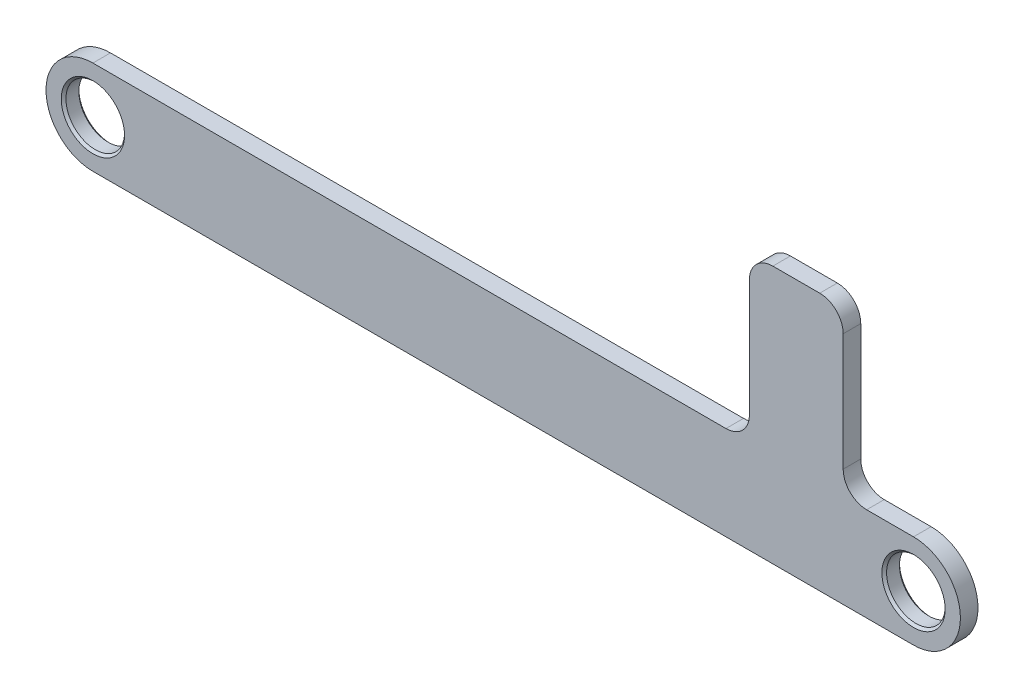
ISO-10303-21;
HEADER;
FILE_DESCRIPTION(('STEP AP214'),'2;1');
FILE_NAME('part.step','',(''),(''),'','','');
FILE_SCHEMA(('AUTOMOTIVE_DESIGN { 1 0 10303 214 1 1 1 1 }'));
ENDSEC;
DATA;
#1=APPLICATION_CONTEXT('core data for automotive mechanical design processes');
#2=APPLICATION_PROTOCOL_DEFINITION('international standard','automotive_design',2000,#1);
#3=PRODUCT_CONTEXT('',#1,'mechanical');
#4=PRODUCT('Part','Part','',(#3));
#5=PRODUCT_RELATED_PRODUCT_CATEGORY('part','',(#4));
#6=PRODUCT_DEFINITION_FORMATION('','',#4);
#7=PRODUCT_DEFINITION_CONTEXT('part definition',#1,'design');
#8=PRODUCT_DEFINITION('design','',#6,#7);
#9=PRODUCT_DEFINITION_SHAPE('','',#8);
#10=(LENGTH_UNIT() NAMED_UNIT(*) SI_UNIT(.MILLI.,.METRE.));
#11=(NAMED_UNIT(*) PLANE_ANGLE_UNIT() SI_UNIT($,.RADIAN.));
#12=(NAMED_UNIT(*) SI_UNIT($,.STERADIAN.) SOLID_ANGLE_UNIT());
#13=UNCERTAINTY_MEASURE_WITH_UNIT(LENGTH_MEASURE(1.E-05),#10,'distance_accuracy_value','');
#14=(GEOMETRIC_REPRESENTATION_CONTEXT(3) GLOBAL_UNCERTAINTY_ASSIGNED_CONTEXT((#13)) GLOBAL_UNIT_ASSIGNED_CONTEXT((#10,
#11,#12)) REPRESENTATION_CONTEXT('',''));
#15=CARTESIAN_POINT('',(0.,0.,0.));
#16=DIRECTION('',(0.,0.,1.));
#17=DIRECTION('',(1.,0.,0.));
#18=AXIS2_PLACEMENT_3D('',#15,#16,#17);
#19=CARTESIAN_POINT('',(0.,0.,0.75));
#20=DIRECTION('',(0.,0.,1.));
#21=DIRECTION('',(1.,0.,0.));
#22=AXIS2_PLACEMENT_3D('',#19,#20,#21);
#23=PLANE('',#22);
#24=CARTESIAN_POINT('',(0.,0.,0.75));
#25=DIRECTION('',(0.,0.,1.));
#26=DIRECTION('',(1.,0.,0.));
#27=AXIS2_PLACEMENT_3D('',#24,#25,#26);
#28=CIRCLE('',#27,2.70000000000001);
#29=CARTESIAN_POINT('',(2.70000000000001,0.,0.75));
#30=VERTEX_POINT('',#29);
#31=EDGE_CURVE('E229',#30,#30,#28,.F.);
#32=ORIENTED_EDGE('',*,*,#31,.T.);
#33=EDGE_LOOP('',(#32));
#34=FACE_BOUND('',#33,.T.);
#35=CARTESIAN_POINT('',(-70.,0.,0.75));
#36=DIRECTION('',(0.,0.,1.));
#37=DIRECTION('',(1.,0.,0.));
#38=AXIS2_PLACEMENT_3D('',#35,#36,#37);
#39=CIRCLE('',#38,2.69999999999998);
#40=CARTESIAN_POINT('',(-67.3,0.,0.75));
#41=VERTEX_POINT('',#40);
#42=EDGE_CURVE('E226',#41,#41,#39,.F.);
#43=ORIENTED_EDGE('',*,*,#42,.T.);
#44=EDGE_LOOP('',(#43));
#45=FACE_BOUND('',#44,.T.);
#46=DIRECTION('',(0.,1.,0.));
#47=VECTOR('',#46,1.);
#48=CARTESIAN_POINT('',(-6.,18.,0.75));
#49=LINE('',#48,#47);
#50=CARTESIAN_POINT('',(-6.,6.,0.75));
#51=VERTEX_POINT('',#50);
#52=CARTESIAN_POINT('',(-6.,16.,0.75));
#53=VERTEX_POINT('',#52);
#54=EDGE_CURVE('E163',#51,#53,#49,.T.);
#55=ORIENTED_EDGE('',*,*,#54,.T.);
#56=CARTESIAN_POINT('',(-8.,16.,0.75));
#57=DIRECTION('',(0.,0.,1.));
#58=DIRECTION('',(1.,0.,0.));
#59=AXIS2_PLACEMENT_3D('',#56,#57,#58);
#60=CIRCLE('',#59,2.);
#61=CARTESIAN_POINT('',(-8.,18.,0.75));
#62=VERTEX_POINT('',#61);
#63=EDGE_CURVE('E49',#53,#62,#60,.T.);
#64=ORIENTED_EDGE('',*,*,#63,.T.);
#65=DIRECTION('',(-1.,0.,0.));
#66=VECTOR('',#65,1.);
#67=CARTESIAN_POINT('',(-14.,18.,0.75));
#68=LINE('',#67,#66);
#69=CARTESIAN_POINT('',(-12.,18.,0.75));
#70=VERTEX_POINT('',#69);
#71=EDGE_CURVE('E165',#62,#70,#68,.T.);
#72=ORIENTED_EDGE('',*,*,#71,.T.);
#73=CARTESIAN_POINT('',(-12.,16.,0.75));
#74=DIRECTION('',(0.,0.,1.));
#75=DIRECTION('',(1.,0.,0.));
#76=AXIS2_PLACEMENT_3D('',#73,#74,#75);
#77=CIRCLE('',#76,2.);
#78=CARTESIAN_POINT('',(-14.,16.,0.75));
#79=VERTEX_POINT('',#78);
#80=EDGE_CURVE('E204',#70,#79,#77,.T.);
#81=ORIENTED_EDGE('',*,*,#80,.T.);
#82=DIRECTION('',(0.,-1.,0.));
#83=VECTOR('',#82,1.);
#84=CARTESIAN_POINT('',(-14.,4.,0.75));
#85=LINE('',#84,#83);
#86=CARTESIAN_POINT('',(-14.,6.,0.75));
#87=VERTEX_POINT('',#86);
#88=EDGE_CURVE('E167',#79,#87,#85,.T.);
#89=ORIENTED_EDGE('',*,*,#88,.T.);
#90=CARTESIAN_POINT('',(-16.,6.,0.75));
#91=DIRECTION('',(0.,0.,1.));
#92=DIRECTION('',(1.,0.,0.));
#93=AXIS2_PLACEMENT_3D('',#90,#91,#92);
#94=CIRCLE('',#93,2.);
#95=CARTESIAN_POINT('',(-16.,4.,0.75));
#96=VERTEX_POINT('',#95);
#97=EDGE_CURVE('E209',#87,#96,#94,.F.);
#98=ORIENTED_EDGE('',*,*,#97,.T.);
#99=DIRECTION('',(-1.,0.,0.));
#100=VECTOR('',#99,1.);
#101=CARTESIAN_POINT('',(-70.,3.99999999999999,0.75));
#102=LINE('',#101,#100);
#103=CARTESIAN_POINT('',(-70.,3.99999999999999,0.75));
#104=VERTEX_POINT('',#103);
#105=EDGE_CURVE('E170',#96,#104,#102,.T.);
#106=ORIENTED_EDGE('',*,*,#105,.T.);
#107=CARTESIAN_POINT('',(-70.,0.,0.75));
#108=DIRECTION('',(0.,0.,1.));
#109=DIRECTION('',(1.,0.,0.));
#110=AXIS2_PLACEMENT_3D('',#107,#108,#109);
#111=CIRCLE('',#110,4.);
#112=CARTESIAN_POINT('',(-70.,-4.00000000000001,0.75));
#113=VERTEX_POINT('',#112);
#114=EDGE_CURVE('E172',#104,#113,#111,.T.);
#115=ORIENTED_EDGE('',*,*,#114,.T.);
#116=DIRECTION('',(1.,0.,0.));
#117=VECTOR('',#116,1.);
#118=CARTESIAN_POINT('',(0.,-3.99999999999999,0.75));
#119=LINE('',#118,#117);
#120=CARTESIAN_POINT('',(0.,-3.99999999999999,0.75));
#121=VERTEX_POINT('',#120);
#122=EDGE_CURVE('E174',#113,#121,#119,.T.);
#123=ORIENTED_EDGE('',*,*,#122,.T.);
#124=CARTESIAN_POINT('',(0.,0.,0.75));
#125=DIRECTION('',(0.,0.,1.));
#126=DIRECTION('',(1.,0.,0.));
#127=AXIS2_PLACEMENT_3D('',#124,#125,#126);
#128=CIRCLE('',#127,3.99999999999999);
#129=CARTESIAN_POINT('',(0.,4.,0.75));
#130=VERTEX_POINT('',#129);
#131=EDGE_CURVE('E160',#121,#130,#128,.T.);
#132=ORIENTED_EDGE('',*,*,#131,.T.);
#133=DIRECTION('',(-1.,0.,0.));
#134=VECTOR('',#133,1.);
#135=CARTESIAN_POINT('',(-6.,4.,0.75));
#136=LINE('',#135,#134);
#137=CARTESIAN_POINT('',(-4.,4.,0.75));
#138=VERTEX_POINT('',#137);
#139=EDGE_CURVE('E135',#130,#138,#136,.T.);
#140=ORIENTED_EDGE('',*,*,#139,.T.);
#141=CARTESIAN_POINT('',(-4.,6.,0.75));
#142=DIRECTION('',(0.,0.,1.));
#143=DIRECTION('',(1.,0.,0.));
#144=AXIS2_PLACEMENT_3D('',#141,#142,#143);
#145=CIRCLE('',#144,2.);
#146=EDGE_CURVE('E212',#138,#51,#145,.F.);
#147=ORIENTED_EDGE('',*,*,#146,.T.);
#148=EDGE_LOOP('',(#55,#64,#72,#81,#89,#98,#106,#115,#123,#132,#140,#147));
#149=FACE_BOUND('',#148,.T.);
#150=ADVANCED_FACE('F27',(#34,#45,#149),#23,.T.);
#151=CARTESIAN_POINT('',(0.,0.,-0.75));
#152=DIRECTION('',(0.,0.,1.));
#153=DIRECTION('',(1.,0.,0.));
#154=AXIS2_PLACEMENT_3D('',#151,#152,#153);
#155=PLANE('',#154);
#156=CARTESIAN_POINT('',(0.,0.,-0.75));
#157=DIRECTION('',(0.,0.,1.));
#158=DIRECTION('',(1.,0.,0.));
#159=AXIS2_PLACEMENT_3D('',#156,#157,#158);
#160=CIRCLE('',#159,2.7);
#161=CARTESIAN_POINT('',(2.7,0.,-0.75));
#162=VERTEX_POINT('',#161);
#163=EDGE_CURVE('E217',#162,#162,#160,.T.);
#164=ORIENTED_EDGE('',*,*,#163,.T.);
#165=EDGE_LOOP('',(#164));
#166=FACE_BOUND('',#165,.T.);
#167=CARTESIAN_POINT('',(-70.,0.,-0.75));
#168=DIRECTION('',(0.,0.,1.));
#169=DIRECTION('',(1.,0.,0.));
#170=AXIS2_PLACEMENT_3D('',#167,#168,#169);
#171=CIRCLE('',#170,2.69999999999998);
#172=CARTESIAN_POINT('',(-67.3,0.,-0.75));
#173=VERTEX_POINT('',#172);
#174=EDGE_CURVE('E214',#173,#173,#171,.T.);
#175=ORIENTED_EDGE('',*,*,#174,.T.);
#176=EDGE_LOOP('',(#175));
#177=FACE_BOUND('',#176,.T.);
#178=DIRECTION('',(-1.,0.,0.));
#179=VECTOR('',#178,1.);
#180=CARTESIAN_POINT('',(-14.,18.,-0.75));
#181=LINE('',#180,#179);
#182=CARTESIAN_POINT('',(-8.,18.,-0.75));
#183=VERTEX_POINT('',#182);
#184=CARTESIAN_POINT('',(-12.,18.,-0.75));
#185=VERTEX_POINT('',#184);
#186=EDGE_CURVE('E149',#183,#185,#181,.T.);
#187=ORIENTED_EDGE('',*,*,#186,.F.);
#188=CARTESIAN_POINT('',(-8.,16.,-0.75));
#189=DIRECTION('',(0.,0.,1.));
#190=DIRECTION('',(1.,0.,0.));
#191=AXIS2_PLACEMENT_3D('',#188,#189,#190);
#192=CIRCLE('',#191,2.);
#193=CARTESIAN_POINT('',(-6.,16.,-0.75));
#194=VERTEX_POINT('',#193);
#195=EDGE_CURVE('E202',#183,#194,#192,.F.);
#196=ORIENTED_EDGE('',*,*,#195,.T.);
#197=DIRECTION('',(0.,1.,0.));
#198=VECTOR('',#197,1.);
#199=CARTESIAN_POINT('',(-6.,18.,-0.75));
#200=LINE('',#199,#198);
#201=CARTESIAN_POINT('',(-6.,6.,-0.75));
#202=VERTEX_POINT('',#201);
#203=EDGE_CURVE('E129',#202,#194,#200,.T.);
#204=ORIENTED_EDGE('',*,*,#203,.F.);
#205=CARTESIAN_POINT('',(-4.,6.,-0.75));
#206=DIRECTION('',(0.,0.,1.));
#207=DIRECTION('',(1.,0.,0.));
#208=AXIS2_PLACEMENT_3D('',#205,#206,#207);
#209=CIRCLE('',#208,2.);
#210=CARTESIAN_POINT('',(-4.,4.,-0.75));
#211=VERTEX_POINT('',#210);
#212=EDGE_CURVE('E126',#202,#211,#209,.T.);
#213=ORIENTED_EDGE('',*,*,#212,.T.);
#214=DIRECTION('',(-1.,0.,0.));
#215=VECTOR('',#214,1.);
#216=CARTESIAN_POINT('',(-6.,4.,-0.75));
#217=LINE('',#216,#215);
#218=CARTESIAN_POINT('',(0.,4.,-0.75));
#219=VERTEX_POINT('',#218);
#220=EDGE_CURVE('E118',#219,#211,#217,.T.);
#221=ORIENTED_EDGE('',*,*,#220,.F.);
#222=CARTESIAN_POINT('',(0.,0.,-0.75));
#223=DIRECTION('',(0.,0.,1.));
#224=DIRECTION('',(1.,0.,0.));
#225=AXIS2_PLACEMENT_3D('',#222,#223,#224);
#226=CIRCLE('',#225,3.99999999999999);
#227=CARTESIAN_POINT('',(0.,-3.99999999999999,-0.75));
#228=VERTEX_POINT('',#227);
#229=EDGE_CURVE('E124',#228,#219,#226,.T.);
#230=ORIENTED_EDGE('',*,*,#229,.F.);
#231=DIRECTION('',(1.,0.,0.));
#232=VECTOR('',#231,1.);
#233=CARTESIAN_POINT('',(0.,-3.99999999999999,-0.75));
#234=LINE('',#233,#232);
#235=CARTESIAN_POINT('',(-70.,-4.00000000000001,-0.75));
#236=VERTEX_POINT('',#235);
#237=EDGE_CURVE('E158',#236,#228,#234,.T.);
#238=ORIENTED_EDGE('',*,*,#237,.F.);
#239=CARTESIAN_POINT('',(-70.,0.,-0.75));
#240=DIRECTION('',(0.,0.,1.));
#241=DIRECTION('',(1.,0.,0.));
#242=AXIS2_PLACEMENT_3D('',#239,#240,#241);
#243=CIRCLE('',#242,4.);
#244=CARTESIAN_POINT('',(-70.,3.99999999999999,-0.75));
#245=VERTEX_POINT('',#244);
#246=EDGE_CURVE('E156',#245,#236,#243,.T.);
#247=ORIENTED_EDGE('',*,*,#246,.F.);
#248=DIRECTION('',(-1.,0.,0.));
#249=VECTOR('',#248,1.);
#250=CARTESIAN_POINT('',(-70.,3.99999999999999,-0.75));
#251=LINE('',#250,#249);
#252=CARTESIAN_POINT('',(-16.,4.,-0.75));
#253=VERTEX_POINT('',#252);
#254=EDGE_CURVE('E154',#253,#245,#251,.T.);
#255=ORIENTED_EDGE('',*,*,#254,.F.);
#256=CARTESIAN_POINT('',(-16.,6.,-0.75));
#257=DIRECTION('',(0.,0.,1.));
#258=DIRECTION('',(1.,0.,0.));
#259=AXIS2_PLACEMENT_3D('',#256,#257,#258);
#260=CIRCLE('',#259,2.);
#261=CARTESIAN_POINT('',(-14.,6.,-0.75));
#262=VERTEX_POINT('',#261);
#263=EDGE_CURVE('E207',#253,#262,#260,.T.);
#264=ORIENTED_EDGE('',*,*,#263,.T.);
#265=DIRECTION('',(0.,-1.,0.));
#266=VECTOR('',#265,1.);
#267=CARTESIAN_POINT('',(-14.,4.,-0.75));
#268=LINE('',#267,#266);
#269=CARTESIAN_POINT('',(-14.,16.,-0.75));
#270=VERTEX_POINT('',#269);
#271=EDGE_CURVE('E151',#270,#262,#268,.T.);
#272=ORIENTED_EDGE('',*,*,#271,.F.);
#273=CARTESIAN_POINT('',(-12.,16.,-0.75));
#274=DIRECTION('',(0.,0.,1.));
#275=DIRECTION('',(1.,0.,0.));
#276=AXIS2_PLACEMENT_3D('',#273,#274,#275);
#277=CIRCLE('',#276,2.);
#278=EDGE_CURVE('E200',#270,#185,#277,.F.);
#279=ORIENTED_EDGE('',*,*,#278,.T.);
#280=EDGE_LOOP('',(#187,#196,#204,#213,#221,#230,#238,#247,#255,#264,#272,#279));
#281=FACE_BOUND('',#280,.T.);
#282=ADVANCED_FACE('F121',(#166,#177,#281),#155,.F.);
#283=CARTESIAN_POINT('',(0.,0.,0.75));
#284=DIRECTION('',(0.,0.,-1.));
#285=DIRECTION('',(-1.,0.,0.));
#286=AXIS2_PLACEMENT_3D('',#283,#284,#285);
#287=CYLINDRICAL_SURFACE('',#286,3.99999999999999);
#288=ORIENTED_EDGE('',*,*,#229,.T.);
#289=DIRECTION('',(0.,0.,-1.));
#290=VECTOR('',#289,1.);
#291=CARTESIAN_POINT('',(0.,4.,0.75));
#292=LINE('',#291,#290);
#293=EDGE_CURVE('E132',#130,#219,#292,.T.);
#294=ORIENTED_EDGE('',*,*,#293,.F.);
#295=ORIENTED_EDGE('',*,*,#131,.F.);
#296=DIRECTION('',(0.,0.,-1.));
#297=VECTOR('',#296,1.);
#298=CARTESIAN_POINT('',(0.,-3.99999999999999,0.75));
#299=LINE('',#298,#297);
#300=EDGE_CURVE('E144',#121,#228,#299,.T.);
#301=ORIENTED_EDGE('',*,*,#300,.T.);
#302=EDGE_LOOP('',(#288,#294,#295,#301));
#303=FACE_BOUND('',#302,.T.);
#304=ADVANCED_FACE('F29',(#303),#287,.T.);
#305=CARTESIAN_POINT('',(-6.,4.,0.75));
#306=DIRECTION('',(0.,-1.,0.));
#307=DIRECTION('',(0.,0.,-1.));
#308=AXIS2_PLACEMENT_3D('',#305,#306,#307);
#309=PLANE('',#308);
#310=ORIENTED_EDGE('',*,*,#220,.T.);
#311=DIRECTION('',(0.,0.,-1.));
#312=VECTOR('',#311,1.);
#313=CARTESIAN_POINT('',(-4.,4.,0.75));
#314=LINE('',#313,#312);
#315=EDGE_CURVE('E194',#211,#138,#314,.F.);
#316=ORIENTED_EDGE('',*,*,#315,.T.);
#317=ORIENTED_EDGE('',*,*,#139,.F.);
#318=ORIENTED_EDGE('',*,*,#293,.T.);
#319=EDGE_LOOP('',(#310,#316,#317,#318));
#320=FACE_BOUND('',#319,.T.);
#321=ADVANCED_FACE('F133',(#320),#309,.F.);
#322=CARTESIAN_POINT('',(-6.,18.,0.75));
#323=DIRECTION('',(-1.,0.,0.));
#324=DIRECTION('',(0.,0.,1.));
#325=AXIS2_PLACEMENT_3D('',#322,#323,#324);
#326=PLANE('',#325);
#327=ORIENTED_EDGE('',*,*,#54,.F.);
#328=DIRECTION('',(0.,0.,-1.));
#329=VECTOR('',#328,1.);
#330=CARTESIAN_POINT('',(-6.,6.,-0.75));
#331=LINE('',#330,#329);
#332=EDGE_CURVE('E191',#51,#202,#331,.T.);
#333=ORIENTED_EDGE('',*,*,#332,.T.);
#334=ORIENTED_EDGE('',*,*,#203,.T.);
#335=DIRECTION('',(0.,0.,-1.));
#336=VECTOR('',#335,1.);
#337=CARTESIAN_POINT('',(-6.,16.,0.75));
#338=LINE('',#337,#336);
#339=EDGE_CURVE('E189',#194,#53,#338,.F.);
#340=ORIENTED_EDGE('',*,*,#339,.T.);
#341=EDGE_LOOP('',(#327,#333,#334,#340));
#342=FACE_BOUND('',#341,.T.);
#343=ADVANCED_FACE('F279',(#342),#326,.F.);
#344=CARTESIAN_POINT('',(-14.,18.,0.75));
#345=DIRECTION('',(0.,-1.,0.));
#346=DIRECTION('',(0.,0.,-1.));
#347=AXIS2_PLACEMENT_3D('',#344,#345,#346);
#348=PLANE('',#347);
#349=ORIENTED_EDGE('',*,*,#71,.F.);
#350=DIRECTION('',(0.,0.,-1.));
#351=VECTOR('',#350,1.);
#352=CARTESIAN_POINT('',(-8.,18.,0.75));
#353=LINE('',#352,#351);
#354=EDGE_CURVE('E197',#62,#183,#353,.T.);
#355=ORIENTED_EDGE('',*,*,#354,.T.);
#356=ORIENTED_EDGE('',*,*,#186,.T.);
#357=DIRECTION('',(0.,0.,-1.));
#358=VECTOR('',#357,1.);
#359=CARTESIAN_POINT('',(-12.,18.,0.75));
#360=LINE('',#359,#358);
#361=EDGE_CURVE('E42',#185,#70,#360,.F.);
#362=ORIENTED_EDGE('',*,*,#361,.T.);
#363=EDGE_LOOP('',(#349,#355,#356,#362));
#364=FACE_BOUND('',#363,.T.);
#365=ADVANCED_FACE('F275',(#364),#348,.F.);
#366=CARTESIAN_POINT('',(-14.,4.,0.75));
#367=DIRECTION('',(1.,0.,0.));
#368=DIRECTION('',(0.,1.,0.));
#369=AXIS2_PLACEMENT_3D('',#366,#367,#368);
#370=PLANE('',#369);
#371=ORIENTED_EDGE('',*,*,#271,.T.);
#372=DIRECTION('',(0.,0.,-1.));
#373=VECTOR('',#372,1.);
#374=CARTESIAN_POINT('',(-14.,6.,0.75));
#375=LINE('',#374,#373);
#376=EDGE_CURVE('E187',#262,#87,#375,.F.);
#377=ORIENTED_EDGE('',*,*,#376,.T.);
#378=ORIENTED_EDGE('',*,*,#88,.F.);
#379=DIRECTION('',(0.,0.,-1.));
#380=VECTOR('',#379,1.);
#381=CARTESIAN_POINT('',(-14.,16.,0.75));
#382=LINE('',#381,#380);
#383=EDGE_CURVE('E184',#79,#270,#382,.T.);
#384=ORIENTED_EDGE('',*,*,#383,.T.);
#385=EDGE_LOOP('',(#371,#377,#378,#384));
#386=FACE_BOUND('',#385,.T.);
#387=ADVANCED_FACE('F271',(#386),#370,.F.);
#388=CARTESIAN_POINT('',(-70.,3.99999999999999,0.75));
#389=DIRECTION('',(0.,-1.,0.));
#390=DIRECTION('',(1.,0.,0.));
#391=AXIS2_PLACEMENT_3D('',#388,#389,#390);
#392=PLANE('',#391);
#393=ORIENTED_EDGE('',*,*,#105,.F.);
#394=DIRECTION('',(0.,0.,-1.));
#395=VECTOR('',#394,1.);
#396=CARTESIAN_POINT('',(-16.,4.,-0.75));
#397=LINE('',#396,#395);
#398=EDGE_CURVE('E139',#96,#253,#397,.T.);
#399=ORIENTED_EDGE('',*,*,#398,.T.);
#400=ORIENTED_EDGE('',*,*,#254,.T.);
#401=DIRECTION('',(0.,0.,-1.));
#402=VECTOR('',#401,1.);
#403=CARTESIAN_POINT('',(-70.,3.99999999999999,0.75));
#404=LINE('',#403,#402);
#405=EDGE_CURVE('E140',#104,#245,#404,.T.);
#406=ORIENTED_EDGE('',*,*,#405,.F.);
#407=EDGE_LOOP('',(#393,#399,#400,#406));
#408=FACE_BOUND('',#407,.T.);
#409=ADVANCED_FACE('F267',(#408),#392,.F.);
#410=CARTESIAN_POINT('',(-70.,0.,0.75));
#411=DIRECTION('',(0.,0.,-1.));
#412=DIRECTION('',(-1.,0.,0.));
#413=AXIS2_PLACEMENT_3D('',#410,#411,#412);
#414=CYLINDRICAL_SURFACE('',#413,4.);
#415=ORIENTED_EDGE('',*,*,#246,.T.);
#416=DIRECTION('',(0.,0.,-1.));
#417=VECTOR('',#416,1.);
#418=CARTESIAN_POINT('',(-70.,-4.00000000000001,0.75));
#419=LINE('',#418,#417);
#420=EDGE_CURVE('E177',#113,#236,#419,.T.);
#421=ORIENTED_EDGE('',*,*,#420,.F.);
#422=ORIENTED_EDGE('',*,*,#114,.F.);
#423=ORIENTED_EDGE('',*,*,#405,.T.);
#424=EDGE_LOOP('',(#415,#421,#422,#423));
#425=FACE_BOUND('',#424,.T.);
#426=ADVANCED_FACE('F263',(#425),#414,.T.);
#427=CARTESIAN_POINT('',(0.,-3.99999999999999,0.75));
#428=DIRECTION('',(0.,1.,0.));
#429=DIRECTION('',(-1.,0.,0.));
#430=AXIS2_PLACEMENT_3D('',#427,#428,#429);
#431=PLANE('',#430);
#432=ORIENTED_EDGE('',*,*,#237,.T.);
#433=ORIENTED_EDGE('',*,*,#300,.F.);
#434=ORIENTED_EDGE('',*,*,#122,.F.);
#435=ORIENTED_EDGE('',*,*,#420,.T.);
#436=EDGE_LOOP('',(#432,#433,#434,#435));
#437=FACE_BOUND('',#436,.T.);
#438=ADVANCED_FACE('F260',(#437),#431,.F.);
#439=CARTESIAN_POINT('',(-70.,0.,0.75));
#440=DIRECTION('',(0.,0.,-1.));
#441=DIRECTION('',(-1.,0.,0.));
#442=AXIS2_PLACEMENT_3D('',#439,#440,#441);
#443=CYLINDRICAL_SURFACE('',#442,2.5);
#444=CARTESIAN_POINT('',(-70.,0.,-0.55000000000002));
#445=DIRECTION('',(0.,0.,1.));
#446=DIRECTION('',(1.,0.,0.));
#447=AXIS2_PLACEMENT_3D('',#444,#445,#446);
#448=CIRCLE('',#447,2.5);
#449=CARTESIAN_POINT('',(-67.5,0.,-0.55000000000002));
#450=VERTEX_POINT('',#449);
#451=EDGE_CURVE('E11',#450,#450,#448,.F.);
#452=ORIENTED_EDGE('',*,*,#451,.T.);
#453=EDGE_LOOP('',(#452));
#454=FACE_BOUND('',#453,.T.);
#455=CARTESIAN_POINT('',(-70.,0.,0.550000000000001));
#456=DIRECTION('',(0.,0.,1.));
#457=DIRECTION('',(1.,0.,0.));
#458=AXIS2_PLACEMENT_3D('',#455,#456,#457);
#459=CIRCLE('',#458,2.5);
#460=CARTESIAN_POINT('',(-67.5,0.,0.550000000000001));
#461=VERTEX_POINT('',#460);
#462=EDGE_CURVE('E35',#461,#461,#459,.T.);
#463=ORIENTED_EDGE('',*,*,#462,.T.);
#464=EDGE_LOOP('',(#463));
#465=FACE_BOUND('',#464,.T.);
#466=ADVANCED_FACE('F234',(#454,#465),#443,.F.);
#467=CARTESIAN_POINT('',(0.,0.,0.75));
#468=DIRECTION('',(0.,0.,-1.));
#469=DIRECTION('',(-1.,0.,0.));
#470=AXIS2_PLACEMENT_3D('',#467,#468,#469);
#471=CYLINDRICAL_SURFACE('',#470,2.5);
#472=CARTESIAN_POINT('',(0.,0.,-0.549999999999998));
#473=DIRECTION('',(0.,0.,1.));
#474=DIRECTION('',(1.,0.,0.));
#475=AXIS2_PLACEMENT_3D('',#472,#473,#474);
#476=CIRCLE('',#475,2.5);
#477=CARTESIAN_POINT('',(2.5,0.,-0.549999999999998));
#478=VERTEX_POINT('',#477);
#479=EDGE_CURVE('E223',#478,#478,#476,.F.);
#480=ORIENTED_EDGE('',*,*,#479,.T.);
#481=EDGE_LOOP('',(#480));
#482=FACE_BOUND('',#481,.T.);
#483=CARTESIAN_POINT('',(0.,0.,0.549999999999985));
#484=DIRECTION('',(0.,0.,1.));
#485=DIRECTION('',(1.,0.,0.));
#486=AXIS2_PLACEMENT_3D('',#483,#484,#485);
#487=CIRCLE('',#486,2.5);
#488=CARTESIAN_POINT('',(2.5,0.,0.549999999999985));
#489=VERTEX_POINT('',#488);
#490=EDGE_CURVE('E220',#489,#489,#487,.T.);
#491=ORIENTED_EDGE('',*,*,#490,.T.);
#492=EDGE_LOOP('',(#491));
#493=FACE_BOUND('',#492,.T.);
#494=ADVANCED_FACE('F305',(#482,#493),#471,.F.);
#495=CARTESIAN_POINT('',(-16.,6.,0.75));
#496=DIRECTION('',(0.,0.,1.));
#497=DIRECTION('',(1.,0.,0.));
#498=AXIS2_PLACEMENT_3D('',#495,#496,#497);
#499=CYLINDRICAL_SURFACE('',#498,2.);
#500=ORIENTED_EDGE('',*,*,#97,.F.);
#501=ORIENTED_EDGE('',*,*,#376,.F.);
#502=ORIENTED_EDGE('',*,*,#263,.F.);
#503=ORIENTED_EDGE('',*,*,#398,.F.);
#504=EDGE_LOOP('',(#500,#501,#502,#503));
#505=FACE_BOUND('',#504,.T.);
#506=ADVANCED_FACE('F312',(#505),#499,.F.);
#507=CARTESIAN_POINT('',(-4.,6.,0.75));
#508=DIRECTION('',(0.,0.,1.));
#509=DIRECTION('',(1.,0.,0.));
#510=AXIS2_PLACEMENT_3D('',#507,#508,#509);
#511=CYLINDRICAL_SURFACE('',#510,2.);
#512=ORIENTED_EDGE('',*,*,#146,.F.);
#513=ORIENTED_EDGE('',*,*,#315,.F.);
#514=ORIENTED_EDGE('',*,*,#212,.F.);
#515=ORIENTED_EDGE('',*,*,#332,.F.);
#516=EDGE_LOOP('',(#512,#513,#514,#515));
#517=FACE_BOUND('',#516,.T.);
#518=ADVANCED_FACE('F321',(#517),#511,.F.);
#519=CARTESIAN_POINT('',(-8.,16.,0.75));
#520=DIRECTION('',(0.,0.,-1.));
#521=DIRECTION('',(-1.,0.,0.));
#522=AXIS2_PLACEMENT_3D('',#519,#520,#521);
#523=CYLINDRICAL_SURFACE('',#522,2.);
#524=ORIENTED_EDGE('',*,*,#63,.F.);
#525=ORIENTED_EDGE('',*,*,#339,.F.);
#526=ORIENTED_EDGE('',*,*,#195,.F.);
#527=ORIENTED_EDGE('',*,*,#354,.F.);
#528=EDGE_LOOP('',(#524,#525,#526,#527));
#529=FACE_BOUND('',#528,.T.);
#530=ADVANCED_FACE('F329',(#529),#523,.T.);
#531=CARTESIAN_POINT('',(-12.,16.,0.75));
#532=DIRECTION('',(0.,0.,-1.));
#533=DIRECTION('',(-1.,0.,0.));
#534=AXIS2_PLACEMENT_3D('',#531,#532,#533);
#535=CYLINDRICAL_SURFACE('',#534,2.);
#536=ORIENTED_EDGE('',*,*,#80,.F.);
#537=ORIENTED_EDGE('',*,*,#361,.F.);
#538=ORIENTED_EDGE('',*,*,#278,.F.);
#539=ORIENTED_EDGE('',*,*,#383,.F.);
#540=EDGE_LOOP('',(#536,#537,#538,#539));
#541=FACE_BOUND('',#540,.T.);
#542=ADVANCED_FACE('F337',(#541),#535,.T.);
#543=CARTESIAN_POINT('',(0.,0.,-0.75));
#544=DIRECTION('',(0.,0.,-1.));
#545=DIRECTION('',(-1.,0.,0.));
#546=AXIS2_PLACEMENT_3D('',#543,#544,#545);
#547=CONICAL_SURFACE('',#546,2.7,0.785398163397446);
#548=ORIENTED_EDGE('',*,*,#479,.F.);
#549=EDGE_LOOP('',(#548));
#550=FACE_BOUND('',#549,.T.);
#551=ORIENTED_EDGE('',*,*,#163,.F.);
#552=EDGE_LOOP('',(#551));
#553=FACE_BOUND('',#552,.T.);
#554=ADVANCED_FACE('F344',(#550,#553),#547,.F.);
#555=CARTESIAN_POINT('',(0.,0.,0.549999999999985));
#556=DIRECTION('',(0.,0.,1.));
#557=DIRECTION('',(1.,0.,0.));
#558=AXIS2_PLACEMENT_3D('',#555,#556,#557);
#559=CONICAL_SURFACE('',#558,2.5,0.78539816339743);
#560=ORIENTED_EDGE('',*,*,#31,.F.);
#561=EDGE_LOOP('',(#560));
#562=FACE_BOUND('',#561,.T.);
#563=ORIENTED_EDGE('',*,*,#490,.F.);
#564=EDGE_LOOP('',(#563));
#565=FACE_BOUND('',#564,.T.);
#566=ADVANCED_FACE('F244',(#562,#565),#559,.F.);
#567=CARTESIAN_POINT('',(-70.,0.,-0.75));
#568=DIRECTION('',(0.,0.,-1.));
#569=DIRECTION('',(-1.,0.,0.));
#570=AXIS2_PLACEMENT_3D('',#567,#568,#569);
#571=CONICAL_SURFACE('',#570,2.69999999999998,0.78539816339746);
#572=ORIENTED_EDGE('',*,*,#451,.F.);
#573=EDGE_LOOP('',(#572));
#574=FACE_BOUND('',#573,.T.);
#575=ORIENTED_EDGE('',*,*,#174,.F.);
#576=EDGE_LOOP('',(#575));
#577=FACE_BOUND('',#576,.T.);
#578=ADVANCED_FACE('F238',(#574,#577),#571,.F.);
#579=CARTESIAN_POINT('',(-70.,0.,0.550000000000001));
#580=DIRECTION('',(0.,0.,1.));
#581=DIRECTION('',(1.,0.,0.));
#582=AXIS2_PLACEMENT_3D('',#579,#580,#581);
#583=CONICAL_SURFACE('',#582,2.5,0.785398163397413);
#584=ORIENTED_EDGE('',*,*,#42,.F.);
#585=EDGE_LOOP('',(#584));
#586=FACE_BOUND('',#585,.T.);
#587=ORIENTED_EDGE('',*,*,#462,.F.);
#588=EDGE_LOOP('',(#587));
#589=FACE_BOUND('',#588,.T.);
#590=ADVANCED_FACE('F236',(#586,#589),#583,.F.);
#591=CLOSED_SHELL('',(#150,#282,#304,#321,#343,#365,#387,#409,#426,#438,#466,#494,#506,#518,
#530,#542,#554,#566,#578,#590));
#592=MANIFOLD_SOLID_BREP('B2',#591);
#593=ADVANCED_BREP_SHAPE_REPRESENTATION('',(#18,#592),#14);
#594=SHAPE_DEFINITION_REPRESENTATION(#9,#593);
ENDSEC;
END-ISO-10303-21;
